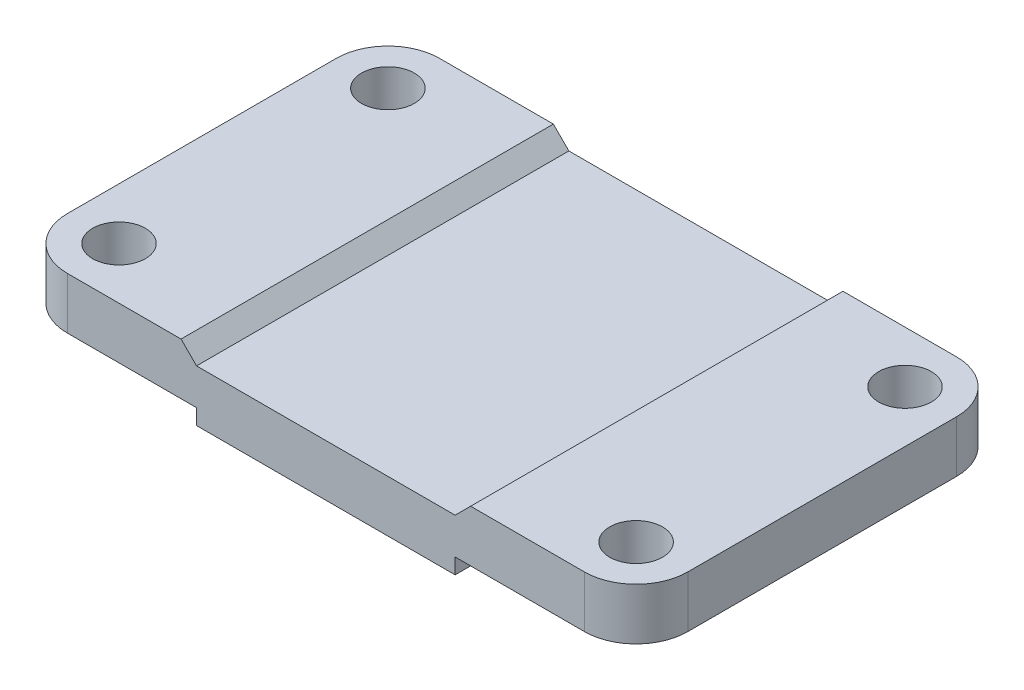
ISO-10303-21;
HEADER;
FILE_DESCRIPTION(('STEP AP214'),'2;1');
FILE_NAME('part.step','',(''),(''),'','','');
FILE_SCHEMA(('AUTOMOTIVE_DESIGN { 1 0 10303 214 1 1 1 1 }'));
ENDSEC;
DATA;
#1=APPLICATION_CONTEXT('core data for automotive mechanical design processes');
#2=APPLICATION_PROTOCOL_DEFINITION('international standard','automotive_design',2000,#1);
#3=PRODUCT_CONTEXT('',#1,'mechanical');
#4=PRODUCT('Part','Part','',(#3));
#5=PRODUCT_RELATED_PRODUCT_CATEGORY('part','',(#4));
#6=PRODUCT_DEFINITION_FORMATION('','',#4);
#7=PRODUCT_DEFINITION_CONTEXT('part definition',#1,'design');
#8=PRODUCT_DEFINITION('design','',#6,#7);
#9=PRODUCT_DEFINITION_SHAPE('','',#8);
#10=(LENGTH_UNIT() NAMED_UNIT(*) SI_UNIT(.MILLI.,.METRE.));
#11=(NAMED_UNIT(*) PLANE_ANGLE_UNIT() SI_UNIT($,.RADIAN.));
#12=(NAMED_UNIT(*) SI_UNIT($,.STERADIAN.) SOLID_ANGLE_UNIT());
#13=UNCERTAINTY_MEASURE_WITH_UNIT(LENGTH_MEASURE(1.E-05),#10,'distance_accuracy_value','');
#14=(GEOMETRIC_REPRESENTATION_CONTEXT(3) GLOBAL_UNCERTAINTY_ASSIGNED_CONTEXT((#13)) GLOBAL_UNIT_ASSIGNED_CONTEXT((#10,
#11,#12)) REPRESENTATION_CONTEXT('',''));
#15=CARTESIAN_POINT('',(0.,0.,0.));
#16=DIRECTION('',(0.,0.,1.));
#17=DIRECTION('',(1.,0.,0.));
#18=AXIS2_PLACEMENT_3D('',#15,#16,#17);
#19=CARTESIAN_POINT('',(0.,10.,0.));
#20=DIRECTION('',(0.,1.,0.));
#21=DIRECTION('',(0.,0.,1.));
#22=AXIS2_PLACEMENT_3D('',#19,#20,#21);
#23=PLANE('',#22);
#24=DIRECTION('',(0.,0.,1.));
#25=VECTOR('',#24,1.);
#26=CARTESIAN_POINT('',(28.,10.,-36.));
#27=LINE('',#26,#25);
#28=CARTESIAN_POINT('',(28.,10.,-36.));
#29=VERTEX_POINT('',#28);
#30=CARTESIAN_POINT('',(28.,10.,36.));
#31=VERTEX_POINT('',#30);
#32=EDGE_CURVE('E205',#29,#31,#27,.T.);
#33=ORIENTED_EDGE('',*,*,#32,.T.);
#34=DIRECTION('',(1.,0.,0.));
#35=VECTOR('',#34,1.);
#36=CARTESIAN_POINT('',(-60.,10.,36.));
#37=LINE('',#36,#35);
#38=CARTESIAN_POINT('',(50.,10.,36.));
#39=VERTEX_POINT('',#38);
#40=EDGE_CURVE('E292',#31,#39,#37,.T.);
#41=ORIENTED_EDGE('',*,*,#40,.T.);
#42=CARTESIAN_POINT('',(50.,10.,26.));
#43=DIRECTION('',(0.,1.,0.));
#44=DIRECTION('',(0.,0.,1.));
#45=AXIS2_PLACEMENT_3D('',#42,#43,#44);
#46=CIRCLE('',#45,10.);
#47=CARTESIAN_POINT('',(60.,10.,26.));
#48=VERTEX_POINT('',#47);
#49=EDGE_CURVE('E342',#39,#48,#46,.T.);
#50=ORIENTED_EDGE('',*,*,#49,.T.);
#51=DIRECTION('',(0.,0.,-1.));
#52=VECTOR('',#51,1.);
#53=CARTESIAN_POINT('',(60.,10.,-36.));
#54=LINE('',#53,#52);
#55=CARTESIAN_POINT('',(60.,10.,-26.));
#56=VERTEX_POINT('',#55);
#57=EDGE_CURVE('E279',#48,#56,#54,.T.);
#58=ORIENTED_EDGE('',*,*,#57,.T.);
#59=CARTESIAN_POINT('',(50.,10.,-26.));
#60=DIRECTION('',(0.,1.,0.));
#61=DIRECTION('',(0.,0.,1.));
#62=AXIS2_PLACEMENT_3D('',#59,#60,#61);
#63=CIRCLE('',#62,10.);
#64=CARTESIAN_POINT('',(50.,10.,-36.));
#65=VERTEX_POINT('',#64);
#66=EDGE_CURVE('E345',#56,#65,#63,.T.);
#67=ORIENTED_EDGE('',*,*,#66,.T.);
#68=DIRECTION('',(-1.,0.,0.));
#69=VECTOR('',#68,1.);
#70=CARTESIAN_POINT('',(-60.,10.,-36.));
#71=LINE('',#70,#69);
#72=EDGE_CURVE('E284',#65,#29,#71,.T.);
#73=ORIENTED_EDGE('',*,*,#72,.T.);
#74=EDGE_LOOP('',(#33,#41,#50,#58,#67,#73));
#75=FACE_BOUND('',#74,.T.);
#76=CARTESIAN_POINT('',(50.,10.,26.));
#77=DIRECTION('',(0.,1.,0.));
#78=DIRECTION('',(0.,0.,1.));
#79=AXIS2_PLACEMENT_3D('',#76,#77,#78);
#80=CIRCLE('',#79,5.1);
#81=CARTESIAN_POINT('',(50.,10.,31.1));
#82=VERTEX_POINT('',#81);
#83=EDGE_CURVE('E258',#82,#82,#80,.T.);
#84=ORIENTED_EDGE('',*,*,#83,.F.);
#85=EDGE_LOOP('',(#84));
#86=FACE_BOUND('',#85,.T.);
#87=CARTESIAN_POINT('',(50.,10.,-26.));
#88=DIRECTION('',(0.,1.,0.));
#89=DIRECTION('',(0.,0.,1.));
#90=AXIS2_PLACEMENT_3D('',#87,#88,#89);
#91=CIRCLE('',#90,5.1);
#92=CARTESIAN_POINT('',(50.,10.,-20.9));
#93=VERTEX_POINT('',#92);
#94=EDGE_CURVE('E250',#93,#93,#91,.T.);
#95=ORIENTED_EDGE('',*,*,#94,.F.);
#96=EDGE_LOOP('',(#95));
#97=FACE_BOUND('',#96,.T.);
#98=ADVANCED_FACE('F55',(#75,#86,#97),#23,.T.);
#99=CARTESIAN_POINT('',(0.,0.,0.));
#100=DIRECTION('',(0.,1.,0.));
#101=DIRECTION('',(0.,0.,1.));
#102=AXIS2_PLACEMENT_3D('',#99,#100,#101);
#103=PLANE('',#102);
#104=CARTESIAN_POINT('',(50.,0.,-26.));
#105=DIRECTION('',(0.,-1.,0.));
#106=DIRECTION('',(0.,0.,-1.));
#107=AXIS2_PLACEMENT_3D('',#104,#105,#106);
#108=CIRCLE('',#107,5.09999999999999);
#109=CARTESIAN_POINT('',(50.,0.,-31.1));
#110=VERTEX_POINT('',#109);
#111=EDGE_CURVE('E239',#110,#110,#108,.T.);
#112=ORIENTED_EDGE('',*,*,#111,.F.);
#113=EDGE_LOOP('',(#112));
#114=FACE_BOUND('',#113,.T.);
#115=CARTESIAN_POINT('',(50.,0.,26.));
#116=DIRECTION('',(0.,-1.,0.));
#117=DIRECTION('',(0.,0.,-1.));
#118=AXIS2_PLACEMENT_3D('',#115,#116,#117);
#119=CIRCLE('',#118,5.09999999999999);
#120=CARTESIAN_POINT('',(50.,0.,20.9));
#121=VERTEX_POINT('',#120);
#122=EDGE_CURVE('E254',#121,#121,#119,.T.);
#123=ORIENTED_EDGE('',*,*,#122,.F.);
#124=EDGE_LOOP('',(#123));
#125=FACE_BOUND('',#124,.T.);
#126=DIRECTION('',(1.,0.,0.));
#127=VECTOR('',#126,1.);
#128=CARTESIAN_POINT('',(-60.,0.,36.));
#129=LINE('',#128,#127);
#130=CARTESIAN_POINT('',(25.,0.,36.));
#131=VERTEX_POINT('',#130);
#132=CARTESIAN_POINT('',(50.,0.,36.));
#133=VERTEX_POINT('',#132);
#134=EDGE_CURVE('E310',#131,#133,#129,.T.);
#135=ORIENTED_EDGE('',*,*,#134,.F.);
#136=DIRECTION('',(0.,0.,-1.));
#137=VECTOR('',#136,1.);
#138=CARTESIAN_POINT('',(25.,0.,-36.));
#139=LINE('',#138,#137);
#140=CARTESIAN_POINT('',(25.,0.,-36.));
#141=VERTEX_POINT('',#140);
#142=EDGE_CURVE('E209',#131,#141,#139,.T.);
#143=ORIENTED_EDGE('',*,*,#142,.T.);
#144=DIRECTION('',(-1.,0.,0.));
#145=VECTOR('',#144,1.);
#146=CARTESIAN_POINT('',(-60.,0.,-36.));
#147=LINE('',#146,#145);
#148=CARTESIAN_POINT('',(50.,0.,-36.));
#149=VERTEX_POINT('',#148);
#150=EDGE_CURVE('E302',#149,#141,#147,.T.);
#151=ORIENTED_EDGE('',*,*,#150,.F.);
#152=CARTESIAN_POINT('',(50.,0.,-26.));
#153=DIRECTION('',(0.,1.,0.));
#154=DIRECTION('',(0.,0.,1.));
#155=AXIS2_PLACEMENT_3D('',#152,#153,#154);
#156=CIRCLE('',#155,10.);
#157=CARTESIAN_POINT('',(60.,0.,-26.));
#158=VERTEX_POINT('',#157);
#159=EDGE_CURVE('E325',#149,#158,#156,.F.);
#160=ORIENTED_EDGE('',*,*,#159,.T.);
#161=DIRECTION('',(0.,0.,-1.));
#162=VECTOR('',#161,1.);
#163=CARTESIAN_POINT('',(60.,0.,-36.));
#164=LINE('',#163,#162);
#165=CARTESIAN_POINT('',(60.,0.,26.));
#166=VERTEX_POINT('',#165);
#167=EDGE_CURVE('E278',#166,#158,#164,.T.);
#168=ORIENTED_EDGE('',*,*,#167,.F.);
#169=CARTESIAN_POINT('',(50.,0.,26.));
#170=DIRECTION('',(0.,1.,0.));
#171=DIRECTION('',(0.,0.,1.));
#172=AXIS2_PLACEMENT_3D('',#169,#170,#171);
#173=CIRCLE('',#172,10.);
#174=EDGE_CURVE('E321',#166,#133,#173,.F.);
#175=ORIENTED_EDGE('',*,*,#174,.T.);
#176=EDGE_LOOP('',(#135,#143,#151,#160,#168,#175));
#177=FACE_BOUND('',#176,.T.);
#178=ADVANCED_FACE('F372',(#114,#125,#177),#103,.F.);
#179=CARTESIAN_POINT('',(-50.,0.,-26.));
#180=DIRECTION('',(0.,-1.,0.));
#181=DIRECTION('',(0.,0.,-1.));
#182=AXIS2_PLACEMENT_3D('',#179,#180,#181);
#183=CIRCLE('',#182,5.09999999999999);
#184=CARTESIAN_POINT('',(-50.,0.,-31.1));
#185=VERTEX_POINT('',#184);
#186=EDGE_CURVE('E270',#185,#185,#183,.T.);
#187=ORIENTED_EDGE('',*,*,#186,.F.);
#188=EDGE_LOOP('',(#187));
#189=FACE_BOUND('',#188,.T.);
#190=CARTESIAN_POINT('',(-25.,0.,-36.));
#191=VERTEX_POINT('',#190);
#192=CARTESIAN_POINT('',(-50.,0.,-36.));
#193=VERTEX_POINT('',#192);
#194=EDGE_CURVE('E301',#191,#193,#147,.T.);
#195=ORIENTED_EDGE('',*,*,#194,.F.);
#196=DIRECTION('',(0.,0.,1.));
#197=VECTOR('',#196,1.);
#198=CARTESIAN_POINT('',(-25.,0.,-36.));
#199=LINE('',#198,#197);
#200=CARTESIAN_POINT('',(-25.,0.,36.));
#201=VERTEX_POINT('',#200);
#202=EDGE_CURVE('E219',#191,#201,#199,.T.);
#203=ORIENTED_EDGE('',*,*,#202,.T.);
#204=CARTESIAN_POINT('',(-50.,0.,36.));
#205=VERTEX_POINT('',#204);
#206=EDGE_CURVE('E283',#205,#201,#129,.T.);
#207=ORIENTED_EDGE('',*,*,#206,.F.);
#208=CARTESIAN_POINT('',(-50.,0.,26.));
#209=DIRECTION('',(0.,1.,0.));
#210=DIRECTION('',(0.,0.,1.));
#211=AXIS2_PLACEMENT_3D('',#208,#209,#210);
#212=CIRCLE('',#211,10.);
#213=CARTESIAN_POINT('',(-60.,0.,26.));
#214=VERTEX_POINT('',#213);
#215=EDGE_CURVE('E332',#205,#214,#212,.F.);
#216=ORIENTED_EDGE('',*,*,#215,.T.);
#217=DIRECTION('',(0.,0.,1.));
#218=VECTOR('',#217,1.);
#219=CARTESIAN_POINT('',(-60.,0.,-36.));
#220=LINE('',#219,#218);
#221=CARTESIAN_POINT('',(-60.,0.,-26.));
#222=VERTEX_POINT('',#221);
#223=EDGE_CURVE('E306',#222,#214,#220,.T.);
#224=ORIENTED_EDGE('',*,*,#223,.F.);
#225=CARTESIAN_POINT('',(-50.,0.,-26.));
#226=DIRECTION('',(0.,1.,0.));
#227=DIRECTION('',(0.,0.,1.));
#228=AXIS2_PLACEMENT_3D('',#225,#226,#227);
#229=CIRCLE('',#228,10.);
#230=EDGE_CURVE('E328',#222,#193,#229,.F.);
#231=ORIENTED_EDGE('',*,*,#230,.T.);
#232=EDGE_LOOP('',(#195,#203,#207,#216,#224,#231));
#233=FACE_BOUND('',#232,.T.);
#234=CARTESIAN_POINT('',(-50.,0.,26.));
#235=DIRECTION('',(0.,-1.,0.));
#236=DIRECTION('',(0.,0.,-1.));
#237=AXIS2_PLACEMENT_3D('',#234,#235,#236);
#238=CIRCLE('',#237,5.09999999999999);
#239=CARTESIAN_POINT('',(-50.,0.,20.9));
#240=VERTEX_POINT('',#239);
#241=EDGE_CURVE('E262',#240,#240,#238,.T.);
#242=ORIENTED_EDGE('',*,*,#241,.F.);
#243=EDGE_LOOP('',(#242));
#244=FACE_BOUND('',#243,.T.);
#245=ADVANCED_FACE('F394',(#189,#233,#244),#103,.F.);
#246=CARTESIAN_POINT('',(60.,10.,-36.));
#247=DIRECTION('',(-1.,0.,0.));
#248=DIRECTION('',(0.,0.,1.));
#249=AXIS2_PLACEMENT_3D('',#246,#247,#248);
#250=PLANE('',#249);
#251=ORIENTED_EDGE('',*,*,#167,.T.);
#252=DIRECTION('',(0.,-1.,0.));
#253=VECTOR('',#252,1.);
#254=CARTESIAN_POINT('',(60.,10.,-26.));
#255=LINE('',#254,#253);
#256=EDGE_CURVE('E13',#158,#56,#255,.F.);
#257=ORIENTED_EDGE('',*,*,#256,.T.);
#258=ORIENTED_EDGE('',*,*,#57,.F.);
#259=DIRECTION('',(0.,-1.,0.));
#260=VECTOR('',#259,1.);
#261=CARTESIAN_POINT('',(60.,10.,26.));
#262=LINE('',#261,#260);
#263=EDGE_CURVE('E64',#48,#166,#262,.T.);
#264=ORIENTED_EDGE('',*,*,#263,.T.);
#265=EDGE_LOOP('',(#251,#257,#258,#264));
#266=FACE_BOUND('',#265,.T.);
#267=ADVANCED_FACE('F366',(#266),#250,.F.);
#268=CARTESIAN_POINT('',(-60.,10.,-36.));
#269=DIRECTION('',(0.,0.,1.));
#270=DIRECTION('',(1.,0.,0.));
#271=AXIS2_PLACEMENT_3D('',#268,#269,#270);
#272=PLANE('',#271);
#273=DIRECTION('',(1.,0.,0.));
#274=VECTOR('',#273,1.);
#275=CARTESIAN_POINT('',(-25.,7.00000000000003,-36.));
#276=LINE('',#275,#274);
#277=CARTESIAN_POINT('',(-25.,7.00000000000003,-36.));
#278=VERTEX_POINT('',#277);
#279=CARTESIAN_POINT('',(25.,7.00000000000003,-36.));
#280=VERTEX_POINT('',#279);
#281=EDGE_CURVE('E180',#278,#280,#276,.T.);
#282=ORIENTED_EDGE('',*,*,#281,.T.);
#283=DIRECTION('',(0.707106781186551,0.707106781186544,0.));
#284=VECTOR('',#283,1.);
#285=CARTESIAN_POINT('',(25.,7.00000000000003,-36.));
#286=LINE('',#285,#284);
#287=EDGE_CURVE('E186',#280,#29,#286,.T.);
#288=ORIENTED_EDGE('',*,*,#287,.T.);
#289=ORIENTED_EDGE('',*,*,#72,.F.);
#290=DIRECTION('',(0.,-1.,0.));
#291=VECTOR('',#290,1.);
#292=CARTESIAN_POINT('',(50.,10.,-36.));
#293=LINE('',#292,#291);
#294=EDGE_CURVE('E354',#65,#149,#293,.T.);
#295=ORIENTED_EDGE('',*,*,#294,.T.);
#296=ORIENTED_EDGE('',*,*,#150,.T.);
#297=DIRECTION('',(0.,1.,0.));
#298=VECTOR('',#297,1.);
#299=CARTESIAN_POINT('',(25.,-3.,-36.));
#300=LINE('',#299,#298);
#301=CARTESIAN_POINT('',(25.,-3.,-36.));
#302=VERTEX_POINT('',#301);
#303=EDGE_CURVE('E230',#302,#141,#300,.T.);
#304=ORIENTED_EDGE('',*,*,#303,.F.);
#305=DIRECTION('',(-1.,0.,0.));
#306=VECTOR('',#305,1.);
#307=CARTESIAN_POINT('',(-25.,-3.,-36.));
#308=LINE('',#307,#306);
#309=CARTESIAN_POINT('',(-25.,-3.,-36.));
#310=VERTEX_POINT('',#309);
#311=EDGE_CURVE('E218',#302,#310,#308,.T.);
#312=ORIENTED_EDGE('',*,*,#311,.T.);
#313=DIRECTION('',(0.,1.,0.));
#314=VECTOR('',#313,1.);
#315=CARTESIAN_POINT('',(-25.,-3.,-36.));
#316=LINE('',#315,#314);
#317=EDGE_CURVE('E242',#310,#191,#316,.T.);
#318=ORIENTED_EDGE('',*,*,#317,.T.);
#319=ORIENTED_EDGE('',*,*,#194,.T.);
#320=DIRECTION('',(0.,-1.,0.));
#321=VECTOR('',#320,1.);
#322=CARTESIAN_POINT('',(-50.,10.,-36.));
#323=LINE('',#322,#321);
#324=CARTESIAN_POINT('',(-50.,10.,-36.));
#325=VERTEX_POINT('',#324);
#326=EDGE_CURVE('E358',#193,#325,#323,.F.);
#327=ORIENTED_EDGE('',*,*,#326,.T.);
#328=CARTESIAN_POINT('',(-28.,10.,-36.));
#329=VERTEX_POINT('',#328);
#330=EDGE_CURVE('E191',#329,#325,#71,.T.);
#331=ORIENTED_EDGE('',*,*,#330,.F.);
#332=DIRECTION('',(0.707106781186551,-0.707106781186544,0.));
#333=VECTOR('',#332,1.);
#334=CARTESIAN_POINT('',(-28.,10.,-36.));
#335=LINE('',#334,#333);
#336=EDGE_CURVE('E71',#329,#278,#335,.T.);
#337=ORIENTED_EDGE('',*,*,#336,.T.);
#338=EDGE_LOOP('',(#282,#288,#289,#295,#296,#304,#312,#318,#319,#327,#331,#337));
#339=FACE_BOUND('',#338,.T.);
#340=ADVANCED_FACE('F189',(#339),#272,.F.);
#341=CARTESIAN_POINT('',(-60.,10.,-36.));
#342=DIRECTION('',(1.,0.,0.));
#343=DIRECTION('',(0.,0.,-1.));
#344=AXIS2_PLACEMENT_3D('',#341,#342,#343);
#345=PLANE('',#344);
#346=ORIENTED_EDGE('',*,*,#223,.T.);
#347=DIRECTION('',(0.,-1.,0.));
#348=VECTOR('',#347,1.);
#349=CARTESIAN_POINT('',(-60.,10.,26.));
#350=LINE('',#349,#348);
#351=CARTESIAN_POINT('',(-60.,10.,26.));
#352=VERTEX_POINT('',#351);
#353=EDGE_CURVE('E339',#214,#352,#350,.F.);
#354=ORIENTED_EDGE('',*,*,#353,.T.);
#355=DIRECTION('',(0.,0.,1.));
#356=VECTOR('',#355,1.);
#357=CARTESIAN_POINT('',(-60.,10.,-36.));
#358=LINE('',#357,#356);
#359=CARTESIAN_POINT('',(-60.,10.,-26.));
#360=VERTEX_POINT('',#359);
#361=EDGE_CURVE('E288',#360,#352,#358,.T.);
#362=ORIENTED_EDGE('',*,*,#361,.F.);
#363=DIRECTION('',(0.,-1.,0.));
#364=VECTOR('',#363,1.);
#365=CARTESIAN_POINT('',(-60.,10.,-26.));
#366=LINE('',#365,#364);
#367=EDGE_CURVE('E335',#360,#222,#366,.T.);
#368=ORIENTED_EDGE('',*,*,#367,.T.);
#369=EDGE_LOOP('',(#346,#354,#362,#368));
#370=FACE_BOUND('',#369,.T.);
#371=ADVANCED_FACE('F405',(#370),#345,.F.);
#372=CARTESIAN_POINT('',(-60.,10.,36.));
#373=DIRECTION('',(0.,0.,-1.));
#374=DIRECTION('',(-1.,0.,0.));
#375=AXIS2_PLACEMENT_3D('',#372,#373,#374);
#376=PLANE('',#375);
#377=ORIENTED_EDGE('',*,*,#40,.F.);
#378=DIRECTION('',(0.707106781186551,0.707106781186544,0.));
#379=VECTOR('',#378,1.);
#380=CARTESIAN_POINT('',(25.,7.00000000000003,36.));
#381=LINE('',#380,#379);
#382=CARTESIAN_POINT('',(25.,7.00000000000003,36.));
#383=VERTEX_POINT('',#382);
#384=EDGE_CURVE('E193',#383,#31,#381,.T.);
#385=ORIENTED_EDGE('',*,*,#384,.F.);
#386=DIRECTION('',(1.,0.,0.));
#387=VECTOR('',#386,1.);
#388=CARTESIAN_POINT('',(-25.,7.00000000000003,36.));
#389=LINE('',#388,#387);
#390=CARTESIAN_POINT('',(-25.,7.00000000000003,36.));
#391=VERTEX_POINT('',#390);
#392=EDGE_CURVE('E196',#391,#383,#389,.T.);
#393=ORIENTED_EDGE('',*,*,#392,.F.);
#394=DIRECTION('',(0.707106781186551,-0.707106781186544,0.));
#395=VECTOR('',#394,1.);
#396=CARTESIAN_POINT('',(-28.,10.,36.));
#397=LINE('',#396,#395);
#398=CARTESIAN_POINT('',(-28.,10.,36.));
#399=VERTEX_POINT('',#398);
#400=EDGE_CURVE('E171',#399,#391,#397,.T.);
#401=ORIENTED_EDGE('',*,*,#400,.F.);
#402=CARTESIAN_POINT('',(-50.,10.,36.));
#403=VERTEX_POINT('',#402);
#404=EDGE_CURVE('E293',#403,#399,#37,.T.);
#405=ORIENTED_EDGE('',*,*,#404,.F.);
#406=DIRECTION('',(0.,-1.,0.));
#407=VECTOR('',#406,1.);
#408=CARTESIAN_POINT('',(-50.,10.,36.));
#409=LINE('',#408,#407);
#410=EDGE_CURVE('E317',#403,#205,#409,.T.);
#411=ORIENTED_EDGE('',*,*,#410,.T.);
#412=ORIENTED_EDGE('',*,*,#206,.T.);
#413=DIRECTION('',(0.,1.,0.));
#414=VECTOR('',#413,1.);
#415=CARTESIAN_POINT('',(-25.,-3.,36.));
#416=LINE('',#415,#414);
#417=CARTESIAN_POINT('',(-25.,-3.,36.));
#418=VERTEX_POINT('',#417);
#419=EDGE_CURVE('E79',#418,#201,#416,.T.);
#420=ORIENTED_EDGE('',*,*,#419,.F.);
#421=DIRECTION('',(1.,0.,0.));
#422=VECTOR('',#421,1.);
#423=CARTESIAN_POINT('',(-25.,-3.,36.));
#424=LINE('',#423,#422);
#425=CARTESIAN_POINT('',(25.,-3.,36.));
#426=VERTEX_POINT('',#425);
#427=EDGE_CURVE('E226',#418,#426,#424,.T.);
#428=ORIENTED_EDGE('',*,*,#427,.T.);
#429=DIRECTION('',(0.,1.,0.));
#430=VECTOR('',#429,1.);
#431=CARTESIAN_POINT('',(25.,-3.,36.));
#432=LINE('',#431,#430);
#433=EDGE_CURVE('E236',#426,#131,#432,.T.);
#434=ORIENTED_EDGE('',*,*,#433,.T.);
#435=ORIENTED_EDGE('',*,*,#134,.T.);
#436=DIRECTION('',(0.,-1.,0.));
#437=VECTOR('',#436,1.);
#438=CARTESIAN_POINT('',(50.,10.,36.));
#439=LINE('',#438,#437);
#440=EDGE_CURVE('E297',#133,#39,#439,.F.);
#441=ORIENTED_EDGE('',*,*,#440,.T.);
#442=EDGE_LOOP('',(#377,#385,#393,#401,#405,#411,#412,#420,#428,#434,#435,#441));
#443=FACE_BOUND('',#442,.T.);
#444=ADVANCED_FACE('F384',(#443),#376,.F.);
#445=DIRECTION('',(0.,0.,1.));
#446=VECTOR('',#445,1.);
#447=CARTESIAN_POINT('',(-28.,10.,-36.));
#448=LINE('',#447,#446);
#449=EDGE_CURVE('E177',#329,#399,#448,.T.);
#450=ORIENTED_EDGE('',*,*,#449,.F.);
#451=ORIENTED_EDGE('',*,*,#330,.T.);
#452=CARTESIAN_POINT('',(-50.,10.,-26.));
#453=DIRECTION('',(0.,1.,0.));
#454=DIRECTION('',(0.,0.,1.));
#455=AXIS2_PLACEMENT_3D('',#452,#453,#454);
#456=CIRCLE('',#455,10.);
#457=EDGE_CURVE('E348',#325,#360,#456,.T.);
#458=ORIENTED_EDGE('',*,*,#457,.T.);
#459=ORIENTED_EDGE('',*,*,#361,.T.);
#460=CARTESIAN_POINT('',(-50.,10.,26.));
#461=DIRECTION('',(0.,1.,0.));
#462=DIRECTION('',(0.,0.,1.));
#463=AXIS2_PLACEMENT_3D('',#460,#461,#462);
#464=CIRCLE('',#463,10.);
#465=EDGE_CURVE('E351',#352,#403,#464,.T.);
#466=ORIENTED_EDGE('',*,*,#465,.T.);
#467=ORIENTED_EDGE('',*,*,#404,.T.);
#468=EDGE_LOOP('',(#450,#451,#458,#459,#466,#467));
#469=FACE_BOUND('',#468,.T.);
#470=CARTESIAN_POINT('',(-50.,10.,26.));
#471=DIRECTION('',(0.,1.,0.));
#472=DIRECTION('',(0.,0.,1.));
#473=AXIS2_PLACEMENT_3D('',#470,#471,#472);
#474=CIRCLE('',#473,5.1);
#475=CARTESIAN_POINT('',(-50.,10.,31.1));
#476=VERTEX_POINT('',#475);
#477=EDGE_CURVE('E266',#476,#476,#474,.T.);
#478=ORIENTED_EDGE('',*,*,#477,.F.);
#479=EDGE_LOOP('',(#478));
#480=FACE_BOUND('',#479,.T.);
#481=CARTESIAN_POINT('',(-50.,10.,-26.));
#482=DIRECTION('',(0.,1.,0.));
#483=DIRECTION('',(0.,0.,1.));
#484=AXIS2_PLACEMENT_3D('',#481,#482,#483);
#485=CIRCLE('',#484,5.1);
#486=CARTESIAN_POINT('',(-50.,10.,-20.9));
#487=VERTEX_POINT('',#486);
#488=EDGE_CURVE('E274',#487,#487,#485,.T.);
#489=ORIENTED_EDGE('',*,*,#488,.F.);
#490=EDGE_LOOP('',(#489));
#491=FACE_BOUND('',#490,.T.);
#492=ADVANCED_FACE('F401',(#469,#480,#491),#23,.T.);
#493=CARTESIAN_POINT('',(-50.,10.,26.));
#494=DIRECTION('',(0.,-1.,0.));
#495=DIRECTION('',(0.,0.,-1.));
#496=AXIS2_PLACEMENT_3D('',#493,#494,#495);
#497=CYLINDRICAL_SURFACE('',#496,10.);
#498=ORIENTED_EDGE('',*,*,#465,.F.);
#499=ORIENTED_EDGE('',*,*,#353,.F.);
#500=ORIENTED_EDGE('',*,*,#215,.F.);
#501=ORIENTED_EDGE('',*,*,#410,.F.);
#502=EDGE_LOOP('',(#498,#499,#500,#501));
#503=FACE_BOUND('',#502,.T.);
#504=ADVANCED_FACE('F408',(#503),#497,.T.);
#505=CARTESIAN_POINT('',(-50.,10.,-26.));
#506=DIRECTION('',(0.,-1.,0.));
#507=DIRECTION('',(0.,0.,-1.));
#508=AXIS2_PLACEMENT_3D('',#505,#506,#507);
#509=CYLINDRICAL_SURFACE('',#508,10.);
#510=ORIENTED_EDGE('',*,*,#457,.F.);
#511=ORIENTED_EDGE('',*,*,#326,.F.);
#512=ORIENTED_EDGE('',*,*,#230,.F.);
#513=ORIENTED_EDGE('',*,*,#367,.F.);
#514=EDGE_LOOP('',(#510,#511,#512,#513));
#515=FACE_BOUND('',#514,.T.);
#516=ADVANCED_FACE('F398',(#515),#509,.T.);
#517=CARTESIAN_POINT('',(50.,10.,-26.));
#518=DIRECTION('',(0.,-1.,0.));
#519=DIRECTION('',(0.,0.,-1.));
#520=AXIS2_PLACEMENT_3D('',#517,#518,#519);
#521=CYLINDRICAL_SURFACE('',#520,10.);
#522=ORIENTED_EDGE('',*,*,#66,.F.);
#523=ORIENTED_EDGE('',*,*,#256,.F.);
#524=ORIENTED_EDGE('',*,*,#159,.F.);
#525=ORIENTED_EDGE('',*,*,#294,.F.);
#526=EDGE_LOOP('',(#522,#523,#524,#525));
#527=FACE_BOUND('',#526,.T.);
#528=ADVANCED_FACE('F378',(#527),#521,.T.);
#529=CARTESIAN_POINT('',(50.,10.,26.));
#530=DIRECTION('',(0.,-1.,0.));
#531=DIRECTION('',(0.,0.,-1.));
#532=AXIS2_PLACEMENT_3D('',#529,#530,#531);
#533=CYLINDRICAL_SURFACE('',#532,10.);
#534=ORIENTED_EDGE('',*,*,#49,.F.);
#535=ORIENTED_EDGE('',*,*,#440,.F.);
#536=ORIENTED_EDGE('',*,*,#174,.F.);
#537=ORIENTED_EDGE('',*,*,#263,.F.);
#538=EDGE_LOOP('',(#534,#535,#536,#537));
#539=FACE_BOUND('',#538,.T.);
#540=ADVANCED_FACE('F57',(#539),#533,.T.);
#541=CARTESIAN_POINT('',(-50.,0.,-26.));
#542=DIRECTION('',(0.,-1.,0.));
#543=DIRECTION('',(0.,0.,-1.));
#544=AXIS2_PLACEMENT_3D('',#541,#542,#543);
#545=CYLINDRICAL_SURFACE('',#544,5.1);
#546=ORIENTED_EDGE('',*,*,#186,.T.);
#547=EDGE_LOOP('',(#546));
#548=FACE_BOUND('',#547,.T.);
#549=ORIENTED_EDGE('',*,*,#488,.T.);
#550=EDGE_LOOP('',(#549));
#551=FACE_BOUND('',#550,.T.);
#552=ADVANCED_FACE('F454',(#548,#551),#545,.F.);
#553=CARTESIAN_POINT('',(-50.,0.,26.));
#554=DIRECTION('',(0.,-1.,0.));
#555=DIRECTION('',(0.,0.,-1.));
#556=AXIS2_PLACEMENT_3D('',#553,#554,#555);
#557=CYLINDRICAL_SURFACE('',#556,5.1);
#558=ORIENTED_EDGE('',*,*,#241,.T.);
#559=EDGE_LOOP('',(#558));
#560=FACE_BOUND('',#559,.T.);
#561=ORIENTED_EDGE('',*,*,#477,.T.);
#562=EDGE_LOOP('',(#561));
#563=FACE_BOUND('',#562,.T.);
#564=ADVANCED_FACE('F458',(#560,#563),#557,.F.);
#565=CARTESIAN_POINT('',(50.,0.,26.));
#566=DIRECTION('',(0.,-1.,0.));
#567=DIRECTION('',(0.,0.,-1.));
#568=AXIS2_PLACEMENT_3D('',#565,#566,#567);
#569=CYLINDRICAL_SURFACE('',#568,5.1);
#570=ORIENTED_EDGE('',*,*,#122,.T.);
#571=EDGE_LOOP('',(#570));
#572=FACE_BOUND('',#571,.T.);
#573=ORIENTED_EDGE('',*,*,#83,.T.);
#574=EDGE_LOOP('',(#573));
#575=FACE_BOUND('',#574,.T.);
#576=ADVANCED_FACE('F463',(#572,#575),#569,.F.);
#577=CARTESIAN_POINT('',(50.,0.,-26.));
#578=DIRECTION('',(0.,-1.,0.));
#579=DIRECTION('',(0.,0.,-1.));
#580=AXIS2_PLACEMENT_3D('',#577,#578,#579);
#581=CYLINDRICAL_SURFACE('',#580,5.1);
#582=ORIENTED_EDGE('',*,*,#111,.T.);
#583=EDGE_LOOP('',(#582));
#584=FACE_BOUND('',#583,.T.);
#585=ORIENTED_EDGE('',*,*,#94,.T.);
#586=EDGE_LOOP('',(#585));
#587=FACE_BOUND('',#586,.T.);
#588=ADVANCED_FACE('F470',(#584,#587),#581,.F.);
#589=CARTESIAN_POINT('',(25.,-3.,-36.));
#590=DIRECTION('',(1.,0.,0.));
#591=DIRECTION('',(0.,0.,-1.));
#592=AXIS2_PLACEMENT_3D('',#589,#590,#591);
#593=PLANE('',#592);
#594=ORIENTED_EDGE('',*,*,#142,.F.);
#595=ORIENTED_EDGE('',*,*,#433,.F.);
#596=DIRECTION('',(0.,0.,-1.));
#597=VECTOR('',#596,1.);
#598=CARTESIAN_POINT('',(25.,-3.,-36.));
#599=LINE('',#598,#597);
#600=EDGE_CURVE('E214',#426,#302,#599,.T.);
#601=ORIENTED_EDGE('',*,*,#600,.T.);
#602=ORIENTED_EDGE('',*,*,#303,.T.);
#603=EDGE_LOOP('',(#594,#595,#601,#602));
#604=FACE_BOUND('',#603,.T.);
#605=ADVANCED_FACE('F474',(#604),#593,.T.);
#606=CARTESIAN_POINT('',(-25.,-3.,-36.));
#607=DIRECTION('',(-1.,0.,0.));
#608=DIRECTION('',(0.,0.,1.));
#609=AXIS2_PLACEMENT_3D('',#606,#607,#608);
#610=PLANE('',#609);
#611=ORIENTED_EDGE('',*,*,#202,.F.);
#612=ORIENTED_EDGE('',*,*,#317,.F.);
#613=DIRECTION('',(0.,0.,1.));
#614=VECTOR('',#613,1.);
#615=CARTESIAN_POINT('',(-25.,-3.,-36.));
#616=LINE('',#615,#614);
#617=EDGE_CURVE('E223',#310,#418,#616,.T.);
#618=ORIENTED_EDGE('',*,*,#617,.T.);
#619=ORIENTED_EDGE('',*,*,#419,.T.);
#620=EDGE_LOOP('',(#611,#612,#618,#619));
#621=FACE_BOUND('',#620,.T.);
#622=ADVANCED_FACE('F422',(#621),#610,.T.);
#623=CARTESIAN_POINT('',(0.,-3.,0.));
#624=DIRECTION('',(0.,1.,0.));
#625=DIRECTION('',(0.,0.,1.));
#626=AXIS2_PLACEMENT_3D('',#623,#624,#625);
#627=PLANE('',#626);
#628=ORIENTED_EDGE('',*,*,#600,.F.);
#629=ORIENTED_EDGE('',*,*,#427,.F.);
#630=ORIENTED_EDGE('',*,*,#617,.F.);
#631=ORIENTED_EDGE('',*,*,#311,.F.);
#632=EDGE_LOOP('',(#628,#629,#630,#631));
#633=FACE_BOUND('',#632,.T.);
#634=ADVANCED_FACE('F415',(#633),#627,.F.);
#635=CARTESIAN_POINT('',(25.,7.00000000000003,-36.));
#636=DIRECTION('',(0.707106781186544,-0.707106781186551,0.));
#637=DIRECTION('',(0.707106781186551,0.707106781186544,0.));
#638=AXIS2_PLACEMENT_3D('',#635,#636,#637);
#639=PLANE('',#638);
#640=ORIENTED_EDGE('',*,*,#384,.T.);
#641=ORIENTED_EDGE('',*,*,#32,.F.);
#642=ORIENTED_EDGE('',*,*,#287,.F.);
#643=DIRECTION('',(0.,0.,1.));
#644=VECTOR('',#643,1.);
#645=CARTESIAN_POINT('',(25.,7.00000000000003,-36.));
#646=LINE('',#645,#644);
#647=EDGE_CURVE('E176',#280,#383,#646,.T.);
#648=ORIENTED_EDGE('',*,*,#647,.T.);
#649=EDGE_LOOP('',(#640,#641,#642,#648));
#650=FACE_BOUND('',#649,.T.);
#651=ADVANCED_FACE('F413',(#650),#639,.F.);
#652=CARTESIAN_POINT('',(-25.,7.00000000000003,-36.));
#653=DIRECTION('',(0.,-1.,0.));
#654=DIRECTION('',(0.,0.,-1.));
#655=AXIS2_PLACEMENT_3D('',#652,#653,#654);
#656=PLANE('',#655);
#657=ORIENTED_EDGE('',*,*,#392,.T.);
#658=ORIENTED_EDGE('',*,*,#647,.F.);
#659=ORIENTED_EDGE('',*,*,#281,.F.);
#660=DIRECTION('',(0.,0.,1.));
#661=VECTOR('',#660,1.);
#662=CARTESIAN_POINT('',(-25.,7.00000000000003,-36.));
#663=LINE('',#662,#661);
#664=EDGE_CURVE('E167',#278,#391,#663,.T.);
#665=ORIENTED_EDGE('',*,*,#664,.T.);
#666=EDGE_LOOP('',(#657,#658,#659,#665));
#667=FACE_BOUND('',#666,.T.);
#668=ADVANCED_FACE('F181',(#667),#656,.F.);
#669=CARTESIAN_POINT('',(-28.,10.,-36.));
#670=DIRECTION('',(-0.707106781186544,-0.707106781186551,0.));
#671=DIRECTION('',(0.707106781186551,-0.707106781186544,0.));
#672=AXIS2_PLACEMENT_3D('',#669,#670,#671);
#673=PLANE('',#672);
#674=ORIENTED_EDGE('',*,*,#400,.T.);
#675=ORIENTED_EDGE('',*,*,#664,.F.);
#676=ORIENTED_EDGE('',*,*,#336,.F.);
#677=ORIENTED_EDGE('',*,*,#449,.T.);
#678=EDGE_LOOP('',(#674,#675,#676,#677));
#679=FACE_BOUND('',#678,.T.);
#680=ADVANCED_FACE('F169',(#679),#673,.F.);
#681=CLOSED_SHELL('',(#98,#178,#245,#267,#340,#371,#444,#492,#504,#516,#528,#540,#552,#564,#576,
#588,#605,#622,#634,#651,#668,#680));
#682=MANIFOLD_SOLID_BREP('B2',#681);
#683=ADVANCED_BREP_SHAPE_REPRESENTATION('',(#18,#682),#14);
#684=SHAPE_DEFINITION_REPRESENTATION(#9,#683);
ENDSEC;
END-ISO-10303-21;
